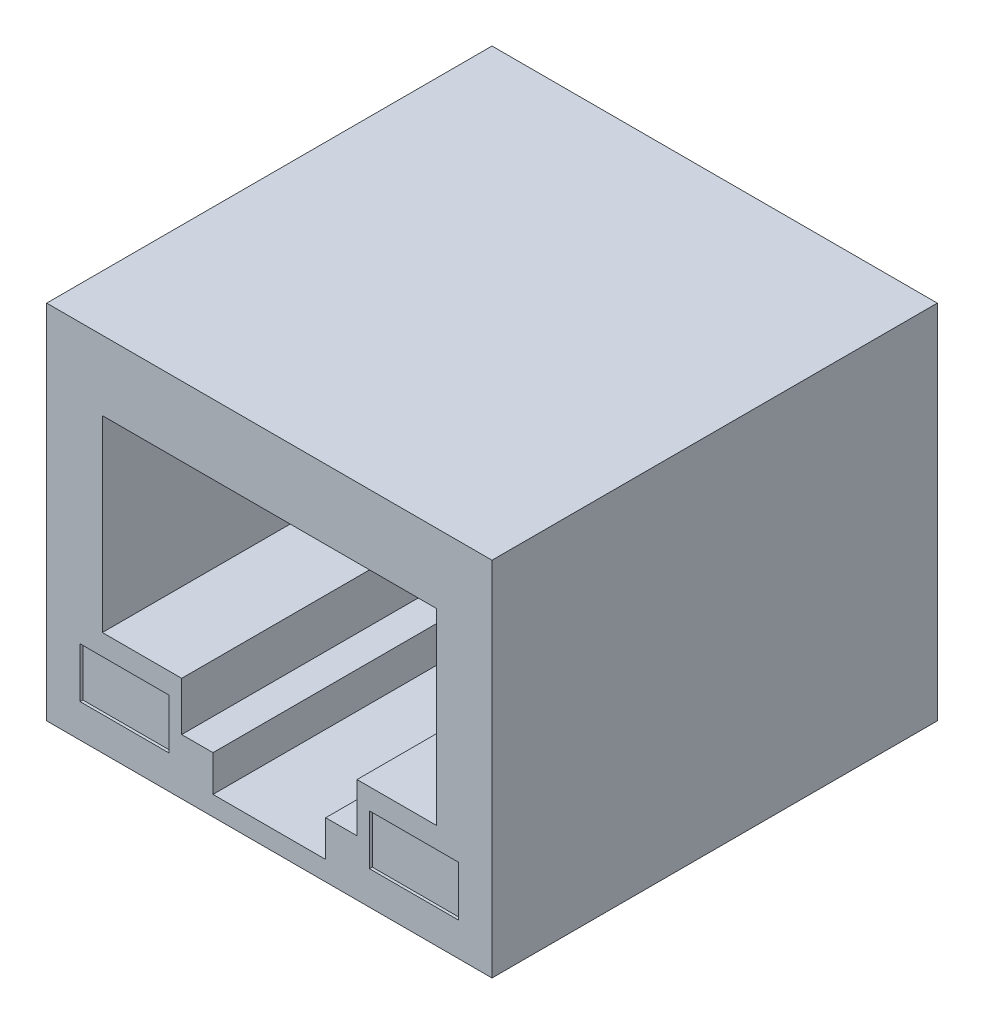
ISO-10303-21;
HEADER;
FILE_DESCRIPTION(('STEP AP214'),'2;1');
FILE_NAME('part.step','',(''),(''),'','','');
FILE_SCHEMA(('AUTOMOTIVE_DESIGN { 1 0 10303 214 1 1 1 1 }'));
ENDSEC;
DATA;
#1=APPLICATION_CONTEXT('core data for automotive mechanical design processes');
#2=APPLICATION_PROTOCOL_DEFINITION('international standard','automotive_design',2000,#1);
#3=PRODUCT_CONTEXT('',#1,'mechanical');
#4=PRODUCT('Part','Part','',(#3));
#5=PRODUCT_RELATED_PRODUCT_CATEGORY('part','',(#4));
#6=PRODUCT_DEFINITION_FORMATION('','',#4);
#7=PRODUCT_DEFINITION_CONTEXT('part definition',#1,'design');
#8=PRODUCT_DEFINITION('design','',#6,#7);
#9=PRODUCT_DEFINITION_SHAPE('','',#8);
#10=(LENGTH_UNIT() NAMED_UNIT(*) SI_UNIT(.MILLI.,.METRE.));
#11=(NAMED_UNIT(*) PLANE_ANGLE_UNIT() SI_UNIT($,.RADIAN.));
#12=(NAMED_UNIT(*) SI_UNIT($,.STERADIAN.) SOLID_ANGLE_UNIT());
#13=UNCERTAINTY_MEASURE_WITH_UNIT(LENGTH_MEASURE(1.E-05),#10,'distance_accuracy_value','');
#14=(GEOMETRIC_REPRESENTATION_CONTEXT(3) GLOBAL_UNCERTAINTY_ASSIGNED_CONTEXT((#13)) GLOBAL_UNIT_ASSIGNED_CONTEXT((#10,
#11,#12)) REPRESENTATION_CONTEXT('',''));
#15=CARTESIAN_POINT('',(0.,0.,0.));
#16=DIRECTION('',(0.,0.,1.));
#17=DIRECTION('',(1.,0.,0.));
#18=AXIS2_PLACEMENT_3D('',#15,#16,#17);
#19=CARTESIAN_POINT('',(-5.2,-8.4,-0.1));
#20=DIRECTION('',(0.,0.,1.));
#21=DIRECTION('',(1.,0.,0.));
#22=AXIS2_PLACEMENT_3D('',#19,#20,#21);
#23=PLANE('',#22);
#24=DIRECTION('',(0.,1.,0.));
#25=VECTOR('',#24,1.);
#26=CARTESIAN_POINT('',(-3.59999999999999,-9.3,-0.1));
#27=LINE('',#26,#25);
#28=CARTESIAN_POINT('',(-3.59999999999999,-9.3,-0.1));
#29=VERTEX_POINT('',#28);
#30=CARTESIAN_POINT('',(-3.59999999999999,-7.5,-0.1));
#31=VERTEX_POINT('',#30);
#32=EDGE_CURVE('E350',#29,#31,#27,.T.);
#33=ORIENTED_EDGE('',*,*,#32,.T.);
#34=DIRECTION('',(1.,0.,0.));
#35=VECTOR('',#34,1.);
#36=CARTESIAN_POINT('',(-3.59999999999999,-7.5,-0.1));
#37=LINE('',#36,#35);
#38=CARTESIAN_POINT('',(-6.8,-7.5,-0.1));
#39=VERTEX_POINT('',#38);
#40=EDGE_CURVE('E355',#31,#39,#37,.F.);
#41=ORIENTED_EDGE('',*,*,#40,.T.);
#42=DIRECTION('',(0.,1.,0.));
#43=VECTOR('',#42,1.);
#44=CARTESIAN_POINT('',(-6.8,-7.5,-0.1));
#45=LINE('',#44,#43);
#46=CARTESIAN_POINT('',(-6.8,-9.3,-0.1));
#47=VERTEX_POINT('',#46);
#48=EDGE_CURVE('E360',#39,#47,#45,.F.);
#49=ORIENTED_EDGE('',*,*,#48,.T.);
#50=DIRECTION('',(1.,0.,0.));
#51=VECTOR('',#50,1.);
#52=CARTESIAN_POINT('',(-6.8,-9.3,-0.1));
#53=LINE('',#52,#51);
#54=EDGE_CURVE('E342',#47,#29,#53,.T.);
#55=ORIENTED_EDGE('',*,*,#54,.T.);
#56=EDGE_LOOP('',(#33,#41,#49,#55));
#57=FACE_BOUND('',#56,.T.);
#58=ADVANCED_FACE('F36',(#57),#23,.T.);
#59=CARTESIAN_POINT('',(5.2,-8.4,-0.1));
#60=DIRECTION('',(0.,0.,1.));
#61=DIRECTION('',(1.,0.,0.));
#62=AXIS2_PLACEMENT_3D('',#59,#60,#61);
#63=PLANE('',#62);
#64=DIRECTION('',(0.,1.,0.));
#65=VECTOR('',#64,1.);
#66=CARTESIAN_POINT('',(6.8,-9.3,-0.1));
#67=LINE('',#66,#65);
#68=CARTESIAN_POINT('',(6.8,-9.3,-0.1));
#69=VERTEX_POINT('',#68);
#70=CARTESIAN_POINT('',(6.8,-7.5,-0.1));
#71=VERTEX_POINT('',#70);
#72=EDGE_CURVE('E330',#69,#71,#67,.T.);
#73=ORIENTED_EDGE('',*,*,#72,.T.);
#74=DIRECTION('',(1.,0.,0.));
#75=VECTOR('',#74,1.);
#76=CARTESIAN_POINT('',(6.8,-7.5,-0.1));
#77=LINE('',#76,#75);
#78=CARTESIAN_POINT('',(3.6,-7.5,-0.1));
#79=VERTEX_POINT('',#78);
#80=EDGE_CURVE('E335',#71,#79,#77,.F.);
#81=ORIENTED_EDGE('',*,*,#80,.T.);
#82=DIRECTION('',(0.,1.,0.));
#83=VECTOR('',#82,1.);
#84=CARTESIAN_POINT('',(3.6,-7.5,-0.1));
#85=LINE('',#84,#83);
#86=CARTESIAN_POINT('',(3.6,-9.3,-0.1));
#87=VERTEX_POINT('',#86);
#88=EDGE_CURVE('E340',#79,#87,#85,.F.);
#89=ORIENTED_EDGE('',*,*,#88,.T.);
#90=DIRECTION('',(1.,0.,0.));
#91=VECTOR('',#90,1.);
#92=CARTESIAN_POINT('',(3.6,-9.3,-0.1));
#93=LINE('',#92,#91);
#94=EDGE_CURVE('E322',#87,#69,#93,.T.);
#95=ORIENTED_EDGE('',*,*,#94,.T.);
#96=EDGE_LOOP('',(#73,#81,#89,#95));
#97=FACE_BOUND('',#96,.T.);
#98=ADVANCED_FACE('F512',(#97),#63,.T.);
#99=CARTESIAN_POINT('',(2.025,-8.5,0.));
#100=DIRECTION('',(0.,-1.,0.));
#101=DIRECTION('',(0.,0.,-1.));
#102=AXIS2_PLACEMENT_3D('',#99,#100,#101);
#103=PLANE('',#102);
#104=DIRECTION('',(0.,0.,-1.));
#105=VECTOR('',#104,1.);
#106=CARTESIAN_POINT('',(2.025,-8.5,0.));
#107=LINE('',#106,#105);
#108=CARTESIAN_POINT('',(2.025,-8.5,-10.7));
#109=VERTEX_POINT('',#108);
#110=CARTESIAN_POINT('',(2.025,-8.5,0.));
#111=VERTEX_POINT('',#110);
#112=EDGE_CURVE('E383',#109,#111,#107,.F.);
#113=ORIENTED_EDGE('',*,*,#112,.T.);
#114=DIRECTION('',(1.,0.,0.));
#115=VECTOR('',#114,1.);
#116=CARTESIAN_POINT('',(2.025,-8.5,0.));
#117=LINE('',#116,#115);
#118=CARTESIAN_POINT('',(3.15,-8.5,0.));
#119=VERTEX_POINT('',#118);
#120=EDGE_CURVE('E191',#119,#111,#117,.F.);
#121=ORIENTED_EDGE('',*,*,#120,.F.);
#122=DIRECTION('',(0.,0.,-1.));
#123=VECTOR('',#122,1.);
#124=CARTESIAN_POINT('',(3.15,-8.5,0.));
#125=LINE('',#124,#123);
#126=CARTESIAN_POINT('',(3.15,-8.5,-10.7));
#127=VERTEX_POINT('',#126);
#128=EDGE_CURVE('E301',#119,#127,#125,.T.);
#129=ORIENTED_EDGE('',*,*,#128,.T.);
#130=DIRECTION('',(1.,0.,0.));
#131=VECTOR('',#130,1.);
#132=CARTESIAN_POINT('',(0.,-8.5,-10.7));
#133=LINE('',#132,#131);
#134=EDGE_CURVE('E362',#109,#127,#133,.T.);
#135=ORIENTED_EDGE('',*,*,#134,.F.);
#136=EDGE_LOOP('',(#113,#121,#129,#135));
#137=FACE_BOUND('',#136,.T.);
#138=ADVANCED_FACE('F387',(#137),#103,.F.);
#139=CARTESIAN_POINT('',(2.025,-9.8,0.));
#140=DIRECTION('',(1.,0.,0.));
#141=DIRECTION('',(0.,0.,-1.));
#142=AXIS2_PLACEMENT_3D('',#139,#140,#141);
#143=PLANE('',#142);
#144=DIRECTION('',(0.,0.,-1.));
#145=VECTOR('',#144,1.);
#146=CARTESIAN_POINT('',(2.025,-9.8,0.));
#147=LINE('',#146,#145);
#148=CARTESIAN_POINT('',(2.025,-9.8,-10.7));
#149=VERTEX_POINT('',#148);
#150=CARTESIAN_POINT('',(2.025,-9.8,0.));
#151=VERTEX_POINT('',#150);
#152=EDGE_CURVE('E295',#149,#151,#147,.F.);
#153=ORIENTED_EDGE('',*,*,#152,.T.);
#154=DIRECTION('',(0.,1.,0.));
#155=VECTOR('',#154,1.);
#156=CARTESIAN_POINT('',(2.025,-9.8,0.));
#157=LINE('',#156,#155);
#158=EDGE_CURVE('E381',#111,#151,#157,.F.);
#159=ORIENTED_EDGE('',*,*,#158,.F.);
#160=ORIENTED_EDGE('',*,*,#112,.F.);
#161=DIRECTION('',(0.,1.,0.));
#162=VECTOR('',#161,1.);
#163=CARTESIAN_POINT('',(2.025,-4.4341743119266,-10.7));
#164=LINE('',#163,#162);
#165=EDGE_CURVE('E365',#149,#109,#164,.T.);
#166=ORIENTED_EDGE('',*,*,#165,.F.);
#167=EDGE_LOOP('',(#153,#159,#160,#166));
#168=FACE_BOUND('',#167,.T.);
#169=ADVANCED_FACE('F390',(#168),#143,.F.);
#170=CARTESIAN_POINT('',(-2.025,-8.5,0.));
#171=DIRECTION('',(-1.,0.,0.));
#172=DIRECTION('',(0.,0.,1.));
#173=AXIS2_PLACEMENT_3D('',#170,#171,#172);
#174=PLANE('',#173);
#175=DIRECTION('',(0.,0.,-1.));
#176=VECTOR('',#175,1.);
#177=CARTESIAN_POINT('',(-2.025,-8.5,0.));
#178=LINE('',#177,#176);
#179=CARTESIAN_POINT('',(-2.025,-8.5,-10.7));
#180=VERTEX_POINT('',#179);
#181=CARTESIAN_POINT('',(-2.025,-8.5,0.));
#182=VERTEX_POINT('',#181);
#183=EDGE_CURVE('E376',#180,#182,#178,.F.);
#184=ORIENTED_EDGE('',*,*,#183,.T.);
#185=DIRECTION('',(0.,1.,0.));
#186=VECTOR('',#185,1.);
#187=CARTESIAN_POINT('',(-2.025,-8.5,0.));
#188=LINE('',#187,#186);
#189=CARTESIAN_POINT('',(-2.025,-9.8,0.));
#190=VERTEX_POINT('',#189);
#191=EDGE_CURVE('E379',#190,#182,#188,.T.);
#192=ORIENTED_EDGE('',*,*,#191,.F.);
#193=DIRECTION('',(0.,0.,-1.));
#194=VECTOR('',#193,1.);
#195=CARTESIAN_POINT('',(-2.025,-9.8,0.));
#196=LINE('',#195,#194);
#197=CARTESIAN_POINT('',(-2.025,-9.8,-10.7));
#198=VERTEX_POINT('',#197);
#199=EDGE_CURVE('E293',#190,#198,#196,.T.);
#200=ORIENTED_EDGE('',*,*,#199,.T.);
#201=DIRECTION('',(0.,1.,0.));
#202=VECTOR('',#201,1.);
#203=CARTESIAN_POINT('',(-2.025,-4.4341743119266,-10.7));
#204=LINE('',#203,#202);
#205=EDGE_CURVE('E368',#180,#198,#204,.F.);
#206=ORIENTED_EDGE('',*,*,#205,.F.);
#207=EDGE_LOOP('',(#184,#192,#200,#206));
#208=FACE_BOUND('',#207,.T.);
#209=ADVANCED_FACE('F401',(#208),#174,.F.);
#210=CARTESIAN_POINT('',(-3.15,-8.5,0.));
#211=DIRECTION('',(0.,-1.,0.));
#212=DIRECTION('',(0.,0.,-1.));
#213=AXIS2_PLACEMENT_3D('',#210,#211,#212);
#214=PLANE('',#213);
#215=DIRECTION('',(0.,0.,1.));
#216=VECTOR('',#215,1.);
#217=CARTESIAN_POINT('',(-3.15,-8.5,0.));
#218=LINE('',#217,#216);
#219=CARTESIAN_POINT('',(-3.15,-8.5,-10.7));
#220=VERTEX_POINT('',#219);
#221=CARTESIAN_POINT('',(-3.15,-8.5,0.));
#222=VERTEX_POINT('',#221);
#223=EDGE_CURVE('E287',#220,#222,#218,.T.);
#224=ORIENTED_EDGE('',*,*,#223,.T.);
#225=DIRECTION('',(1.,0.,0.));
#226=VECTOR('',#225,1.);
#227=CARTESIAN_POINT('',(-3.15,-8.5,0.));
#228=LINE('',#227,#226);
#229=EDGE_CURVE('E374',#182,#222,#228,.F.);
#230=ORIENTED_EDGE('',*,*,#229,.F.);
#231=ORIENTED_EDGE('',*,*,#183,.F.);
#232=DIRECTION('',(1.,0.,0.));
#233=VECTOR('',#232,1.);
#234=CARTESIAN_POINT('',(0.,-8.5,-10.7));
#235=LINE('',#234,#233);
#236=EDGE_CURVE('E371',#220,#180,#235,.T.);
#237=ORIENTED_EDGE('',*,*,#236,.F.);
#238=EDGE_LOOP('',(#224,#230,#231,#237));
#239=FACE_BOUND('',#238,.T.);
#240=ADVANCED_FACE('F406',(#239),#214,.F.);
#241=CARTESIAN_POINT('',(0.,-4.4341743119266,-10.7));
#242=DIRECTION('',(0.,0.,1.));
#243=DIRECTION('',(1.,0.,0.));
#244=AXIS2_PLACEMENT_3D('',#241,#242,#243);
#245=PLANE('',#244);
#246=DIRECTION('',(0.,1.,0.));
#247=VECTOR('',#246,1.);
#248=CARTESIAN_POINT('',(6.,-6.75,-10.7));
#249=LINE('',#248,#247);
#250=CARTESIAN_POINT('',(6.,-6.75,-10.7));
#251=VERTEX_POINT('',#250);
#252=CARTESIAN_POINT('',(6.00000000000001,0.,-10.7));
#253=VERTEX_POINT('',#252);
#254=EDGE_CURVE('E310',#251,#253,#249,.T.);
#255=ORIENTED_EDGE('',*,*,#254,.T.);
#256=DIRECTION('',(1.,0.,0.));
#257=VECTOR('',#256,1.);
#258=CARTESIAN_POINT('',(0.,0.,-10.7));
#259=LINE('',#258,#257);
#260=CARTESIAN_POINT('',(-6.00000000000001,0.,-10.7));
#261=VERTEX_POINT('',#260);
#262=EDGE_CURVE('E315',#253,#261,#259,.F.);
#263=ORIENTED_EDGE('',*,*,#262,.T.);
#264=DIRECTION('',(0.,1.,0.));
#265=VECTOR('',#264,1.);
#266=CARTESIAN_POINT('',(-6.00000000000001,0.,-10.7));
#267=LINE('',#266,#265);
#268=CARTESIAN_POINT('',(-6.00000000000001,-6.75,-10.7));
#269=VERTEX_POINT('',#268);
#270=EDGE_CURVE('E320',#261,#269,#267,.F.);
#271=ORIENTED_EDGE('',*,*,#270,.T.);
#272=DIRECTION('',(1.,0.,0.));
#273=VECTOR('',#272,1.);
#274=CARTESIAN_POINT('',(-6.,-6.75,-10.7));
#275=LINE('',#274,#273);
#276=CARTESIAN_POINT('',(-3.15,-6.75,-10.7));
#277=VERTEX_POINT('',#276);
#278=EDGE_CURVE('E276',#269,#277,#275,.T.);
#279=ORIENTED_EDGE('',*,*,#278,.T.);
#280=DIRECTION('',(0.,1.,0.));
#281=VECTOR('',#280,1.);
#282=CARTESIAN_POINT('',(-3.15,-6.75,-10.7));
#283=LINE('',#282,#281);
#284=EDGE_CURVE('E284',#277,#220,#283,.F.);
#285=ORIENTED_EDGE('',*,*,#284,.T.);
#286=ORIENTED_EDGE('',*,*,#236,.T.);
#287=ORIENTED_EDGE('',*,*,#205,.T.);
#288=DIRECTION('',(1.,0.,0.));
#289=VECTOR('',#288,1.);
#290=CARTESIAN_POINT('',(-2.025,-9.8,-10.7));
#291=LINE('',#290,#289);
#292=EDGE_CURVE('E290',#198,#149,#291,.T.);
#293=ORIENTED_EDGE('',*,*,#292,.T.);
#294=ORIENTED_EDGE('',*,*,#165,.T.);
#295=ORIENTED_EDGE('',*,*,#134,.T.);
#296=DIRECTION('',(0.,1.,0.));
#297=VECTOR('',#296,1.);
#298=CARTESIAN_POINT('',(3.15,-8.5,-10.7));
#299=LINE('',#298,#297);
#300=CARTESIAN_POINT('',(3.15,-6.75,-10.7));
#301=VERTEX_POINT('',#300);
#302=EDGE_CURVE('E298',#127,#301,#299,.T.);
#303=ORIENTED_EDGE('',*,*,#302,.T.);
#304=DIRECTION('',(1.,0.,0.));
#305=VECTOR('',#304,1.);
#306=CARTESIAN_POINT('',(3.15,-6.75,-10.7));
#307=LINE('',#306,#305);
#308=EDGE_CURVE('E305',#301,#251,#307,.T.);
#309=ORIENTED_EDGE('',*,*,#308,.T.);
#310=EDGE_LOOP('',(#255,#263,#271,#279,#285,#286,#287,#293,#294,#295,#303,#309));
#311=FACE_BOUND('',#310,.T.);
#312=ADVANCED_FACE('F403',(#311),#245,.T.);
#313=CARTESIAN_POINT('',(-6.8,-7.5,0.));
#314=DIRECTION('',(-1.,0.,0.));
#315=DIRECTION('',(0.,0.,1.));
#316=AXIS2_PLACEMENT_3D('',#313,#314,#315);
#317=PLANE('',#316);
#318=DIRECTION('',(0.,0.,1.));
#319=VECTOR('',#318,1.);
#320=CARTESIAN_POINT('',(-6.8,-7.5,0.));
#321=LINE('',#320,#319);
#322=CARTESIAN_POINT('',(-6.8,-7.5,0.));
#323=VERTEX_POINT('',#322);
#324=EDGE_CURVE('E358',#39,#323,#321,.T.);
#325=ORIENTED_EDGE('',*,*,#324,.T.);
#326=DIRECTION('',(0.,1.,0.));
#327=VECTOR('',#326,1.);
#328=CARTESIAN_POINT('',(-6.8,-4.,0.));
#329=LINE('',#328,#327);
#330=CARTESIAN_POINT('',(-6.8,-9.3,0.));
#331=VERTEX_POINT('',#330);
#332=EDGE_CURVE('E266',#331,#323,#329,.T.);
#333=ORIENTED_EDGE('',*,*,#332,.F.);
#334=DIRECTION('',(0.,0.,-1.));
#335=VECTOR('',#334,1.);
#336=CARTESIAN_POINT('',(-6.8,-9.3,0.));
#337=LINE('',#336,#335);
#338=EDGE_CURVE('E345',#331,#47,#337,.T.);
#339=ORIENTED_EDGE('',*,*,#338,.T.);
#340=ORIENTED_EDGE('',*,*,#48,.F.);
#341=EDGE_LOOP('',(#325,#333,#339,#340));
#342=FACE_BOUND('',#341,.T.);
#343=ADVANCED_FACE('F567',(#342),#317,.F.);
#344=CARTESIAN_POINT('',(-3.59999999999999,-7.5,0.));
#345=DIRECTION('',(0.,1.,0.));
#346=DIRECTION('',(0.,0.,1.));
#347=AXIS2_PLACEMENT_3D('',#344,#345,#346);
#348=PLANE('',#347);
#349=DIRECTION('',(0.,0.,-1.));
#350=VECTOR('',#349,1.);
#351=CARTESIAN_POINT('',(-3.59999999999999,-7.5,0.));
#352=LINE('',#351,#350);
#353=CARTESIAN_POINT('',(-3.59999999999999,-7.5,0.));
#354=VERTEX_POINT('',#353);
#355=EDGE_CURVE('E353',#31,#354,#352,.F.);
#356=ORIENTED_EDGE('',*,*,#355,.T.);
#357=DIRECTION('',(1.,0.,0.));
#358=VECTOR('',#357,1.);
#359=CARTESIAN_POINT('',(0.,-7.5,0.));
#360=LINE('',#359,#358);
#361=EDGE_CURVE('E263',#323,#354,#360,.T.);
#362=ORIENTED_EDGE('',*,*,#361,.F.);
#363=ORIENTED_EDGE('',*,*,#324,.F.);
#364=ORIENTED_EDGE('',*,*,#40,.F.);
#365=EDGE_LOOP('',(#356,#362,#363,#364));
#366=FACE_BOUND('',#365,.T.);
#367=ADVANCED_FACE('F577',(#366),#348,.F.);
#368=CARTESIAN_POINT('',(-3.59999999999999,-9.3,0.));
#369=DIRECTION('',(1.,0.,0.));
#370=DIRECTION('',(0.,0.,-1.));
#371=AXIS2_PLACEMENT_3D('',#368,#369,#370);
#372=PLANE('',#371);
#373=DIRECTION('',(0.,0.,-1.));
#374=VECTOR('',#373,1.);
#375=CARTESIAN_POINT('',(-3.59999999999999,-9.3,0.));
#376=LINE('',#375,#374);
#377=CARTESIAN_POINT('',(-3.59999999999999,-9.3,0.));
#378=VERTEX_POINT('',#377);
#379=EDGE_CURVE('E348',#29,#378,#376,.F.);
#380=ORIENTED_EDGE('',*,*,#379,.T.);
#381=DIRECTION('',(0.,1.,0.));
#382=VECTOR('',#381,1.);
#383=CARTESIAN_POINT('',(-3.59999999999999,-4.,0.));
#384=LINE('',#383,#382);
#385=EDGE_CURVE('E260',#354,#378,#384,.F.);
#386=ORIENTED_EDGE('',*,*,#385,.F.);
#387=ORIENTED_EDGE('',*,*,#355,.F.);
#388=ORIENTED_EDGE('',*,*,#32,.F.);
#389=EDGE_LOOP('',(#380,#386,#387,#388));
#390=FACE_BOUND('',#389,.T.);
#391=ADVANCED_FACE('F588',(#390),#372,.F.);
#392=CARTESIAN_POINT('',(-6.8,-9.3,0.));
#393=DIRECTION('',(0.,-1.,0.));
#394=DIRECTION('',(0.,0.,-1.));
#395=AXIS2_PLACEMENT_3D('',#392,#393,#394);
#396=PLANE('',#395);
#397=ORIENTED_EDGE('',*,*,#338,.F.);
#398=DIRECTION('',(1.,0.,0.));
#399=VECTOR('',#398,1.);
#400=CARTESIAN_POINT('',(0.,-9.3,0.));
#401=LINE('',#400,#399);
#402=EDGE_CURVE('E257',#378,#331,#401,.F.);
#403=ORIENTED_EDGE('',*,*,#402,.F.);
#404=ORIENTED_EDGE('',*,*,#379,.F.);
#405=ORIENTED_EDGE('',*,*,#54,.F.);
#406=EDGE_LOOP('',(#397,#403,#404,#405));
#407=FACE_BOUND('',#406,.T.);
#408=ADVANCED_FACE('F599',(#407),#396,.F.);
#409=CARTESIAN_POINT('',(3.6,-7.5,0.));
#410=DIRECTION('',(-1.,0.,0.));
#411=DIRECTION('',(0.,0.,1.));
#412=AXIS2_PLACEMENT_3D('',#409,#410,#411);
#413=PLANE('',#412);
#414=DIRECTION('',(0.,0.,1.));
#415=VECTOR('',#414,1.);
#416=CARTESIAN_POINT('',(3.6,-7.5,0.));
#417=LINE('',#416,#415);
#418=CARTESIAN_POINT('',(3.6,-7.5,0.));
#419=VERTEX_POINT('',#418);
#420=EDGE_CURVE('E338',#79,#419,#417,.T.);
#421=ORIENTED_EDGE('',*,*,#420,.T.);
#422=DIRECTION('',(0.,1.,0.));
#423=VECTOR('',#422,1.);
#424=CARTESIAN_POINT('',(3.6,-4.,0.));
#425=LINE('',#424,#423);
#426=CARTESIAN_POINT('',(3.6,-9.3,0.));
#427=VERTEX_POINT('',#426);
#428=EDGE_CURVE('E254',#427,#419,#425,.T.);
#429=ORIENTED_EDGE('',*,*,#428,.F.);
#430=DIRECTION('',(0.,0.,-1.));
#431=VECTOR('',#430,1.);
#432=CARTESIAN_POINT('',(3.6,-9.3,0.));
#433=LINE('',#432,#431);
#434=EDGE_CURVE('E325',#427,#87,#433,.T.);
#435=ORIENTED_EDGE('',*,*,#434,.T.);
#436=ORIENTED_EDGE('',*,*,#88,.F.);
#437=EDGE_LOOP('',(#421,#429,#435,#436));
#438=FACE_BOUND('',#437,.T.);
#439=ADVANCED_FACE('F610',(#438),#413,.F.);
#440=CARTESIAN_POINT('',(6.8,-7.5,0.));
#441=DIRECTION('',(0.,1.,0.));
#442=DIRECTION('',(0.,0.,1.));
#443=AXIS2_PLACEMENT_3D('',#440,#441,#442);
#444=PLANE('',#443);
#445=DIRECTION('',(0.,0.,-1.));
#446=VECTOR('',#445,1.);
#447=CARTESIAN_POINT('',(6.8,-7.5,0.));
#448=LINE('',#447,#446);
#449=CARTESIAN_POINT('',(6.8,-7.5,0.));
#450=VERTEX_POINT('',#449);
#451=EDGE_CURVE('E333',#71,#450,#448,.F.);
#452=ORIENTED_EDGE('',*,*,#451,.T.);
#453=DIRECTION('',(1.,0.,0.));
#454=VECTOR('',#453,1.);
#455=CARTESIAN_POINT('',(0.,-7.5,0.));
#456=LINE('',#455,#454);
#457=EDGE_CURVE('E251',#419,#450,#456,.T.);
#458=ORIENTED_EDGE('',*,*,#457,.F.);
#459=ORIENTED_EDGE('',*,*,#420,.F.);
#460=ORIENTED_EDGE('',*,*,#80,.F.);
#461=EDGE_LOOP('',(#452,#458,#459,#460));
#462=FACE_BOUND('',#461,.T.);
#463=ADVANCED_FACE('F621',(#462),#444,.F.);
#464=CARTESIAN_POINT('',(6.8,-9.3,0.));
#465=DIRECTION('',(1.,0.,0.));
#466=DIRECTION('',(0.,0.,-1.));
#467=AXIS2_PLACEMENT_3D('',#464,#465,#466);
#468=PLANE('',#467);
#469=DIRECTION('',(0.,0.,-1.));
#470=VECTOR('',#469,1.);
#471=CARTESIAN_POINT('',(6.8,-9.3,0.));
#472=LINE('',#471,#470);
#473=CARTESIAN_POINT('',(6.8,-9.3,0.));
#474=VERTEX_POINT('',#473);
#475=EDGE_CURVE('E328',#69,#474,#472,.F.);
#476=ORIENTED_EDGE('',*,*,#475,.T.);
#477=DIRECTION('',(0.,1.,0.));
#478=VECTOR('',#477,1.);
#479=CARTESIAN_POINT('',(6.8,-4.,0.));
#480=LINE('',#479,#478);
#481=EDGE_CURVE('E248',#450,#474,#480,.F.);
#482=ORIENTED_EDGE('',*,*,#481,.F.);
#483=ORIENTED_EDGE('',*,*,#451,.F.);
#484=ORIENTED_EDGE('',*,*,#72,.F.);
#485=EDGE_LOOP('',(#476,#482,#483,#484));
#486=FACE_BOUND('',#485,.T.);
#487=ADVANCED_FACE('F632',(#486),#468,.F.);
#488=CARTESIAN_POINT('',(3.6,-9.3,0.));
#489=DIRECTION('',(0.,-1.,0.));
#490=DIRECTION('',(0.,0.,-1.));
#491=AXIS2_PLACEMENT_3D('',#488,#489,#490);
#492=PLANE('',#491);
#493=ORIENTED_EDGE('',*,*,#434,.F.);
#494=DIRECTION('',(1.,0.,0.));
#495=VECTOR('',#494,1.);
#496=CARTESIAN_POINT('',(0.,-9.3,0.));
#497=LINE('',#496,#495);
#498=EDGE_CURVE('E245',#474,#427,#497,.F.);
#499=ORIENTED_EDGE('',*,*,#498,.F.);
#500=ORIENTED_EDGE('',*,*,#475,.F.);
#501=ORIENTED_EDGE('',*,*,#94,.F.);
#502=EDGE_LOOP('',(#493,#499,#500,#501));
#503=FACE_BOUND('',#502,.T.);
#504=ADVANCED_FACE('F643',(#503),#492,.F.);
#505=CARTESIAN_POINT('',(-6.00000000000001,0.,0.));
#506=DIRECTION('',(-1.,0.,0.));
#507=DIRECTION('',(0.,0.,1.));
#508=AXIS2_PLACEMENT_3D('',#505,#506,#507);
#509=PLANE('',#508);
#510=DIRECTION('',(0.,0.,1.));
#511=VECTOR('',#510,1.);
#512=CARTESIAN_POINT('',(-6.00000000000001,0.,0.));
#513=LINE('',#512,#511);
#514=CARTESIAN_POINT('',(-6.00000000000001,0.,0.));
#515=VERTEX_POINT('',#514);
#516=EDGE_CURVE('E318',#261,#515,#513,.T.);
#517=ORIENTED_EDGE('',*,*,#516,.T.);
#518=DIRECTION('',(0.,1.,0.));
#519=VECTOR('',#518,1.);
#520=CARTESIAN_POINT('',(-6.,-4.,0.));
#521=LINE('',#520,#519);
#522=CARTESIAN_POINT('',(-6.00000000000001,-6.75,0.));
#523=VERTEX_POINT('',#522);
#524=EDGE_CURVE('E242',#523,#515,#521,.T.);
#525=ORIENTED_EDGE('',*,*,#524,.F.);
#526=DIRECTION('',(0.,0.,-1.));
#527=VECTOR('',#526,1.);
#528=CARTESIAN_POINT('',(-6.,-6.75,0.));
#529=LINE('',#528,#527);
#530=EDGE_CURVE('E279',#523,#269,#529,.T.);
#531=ORIENTED_EDGE('',*,*,#530,.T.);
#532=ORIENTED_EDGE('',*,*,#270,.F.);
#533=EDGE_LOOP('',(#517,#525,#531,#532));
#534=FACE_BOUND('',#533,.T.);
#535=ADVANCED_FACE('F418',(#534),#509,.F.);
#536=CARTESIAN_POINT('',(0.,0.,0.));
#537=DIRECTION('',(0.,1.,0.));
#538=DIRECTION('',(0.,0.,1.));
#539=AXIS2_PLACEMENT_3D('',#536,#537,#538);
#540=PLANE('',#539);
#541=DIRECTION('',(0.,0.,-1.));
#542=VECTOR('',#541,1.);
#543=CARTESIAN_POINT('',(6.,0.,0.));
#544=LINE('',#543,#542);
#545=CARTESIAN_POINT('',(6.00000000000001,0.,0.));
#546=VERTEX_POINT('',#545);
#547=EDGE_CURVE('E313',#253,#546,#544,.F.);
#548=ORIENTED_EDGE('',*,*,#547,.T.);
#549=DIRECTION('',(1.,0.,0.));
#550=VECTOR('',#549,1.);
#551=CARTESIAN_POINT('',(0.,0.,0.));
#552=LINE('',#551,#550);
#553=EDGE_CURVE('E239',#515,#546,#552,.T.);
#554=ORIENTED_EDGE('',*,*,#553,.F.);
#555=ORIENTED_EDGE('',*,*,#516,.F.);
#556=ORIENTED_EDGE('',*,*,#262,.F.);
#557=EDGE_LOOP('',(#548,#554,#555,#556));
#558=FACE_BOUND('',#557,.T.);
#559=ADVANCED_FACE('F423',(#558),#540,.F.);
#560=CARTESIAN_POINT('',(6.,-6.75,0.));
#561=DIRECTION('',(1.,0.,0.));
#562=DIRECTION('',(0.,0.,-1.));
#563=AXIS2_PLACEMENT_3D('',#560,#561,#562);
#564=PLANE('',#563);
#565=DIRECTION('',(0.,0.,-1.));
#566=VECTOR('',#565,1.);
#567=CARTESIAN_POINT('',(6.,-6.75,0.));
#568=LINE('',#567,#566);
#569=CARTESIAN_POINT('',(6.,-6.75,0.));
#570=VERTEX_POINT('',#569);
#571=EDGE_CURVE('E308',#251,#570,#568,.F.);
#572=ORIENTED_EDGE('',*,*,#571,.T.);
#573=DIRECTION('',(0.,1.,0.));
#574=VECTOR('',#573,1.);
#575=CARTESIAN_POINT('',(6.00000000000001,-4.,0.));
#576=LINE('',#575,#574);
#577=EDGE_CURVE('E236',#546,#570,#576,.F.);
#578=ORIENTED_EDGE('',*,*,#577,.F.);
#579=ORIENTED_EDGE('',*,*,#547,.F.);
#580=ORIENTED_EDGE('',*,*,#254,.F.);
#581=EDGE_LOOP('',(#572,#578,#579,#580));
#582=FACE_BOUND('',#581,.T.);
#583=ADVANCED_FACE('F426',(#582),#564,.F.);
#584=CARTESIAN_POINT('',(3.15,-6.75,0.));
#585=DIRECTION('',(0.,-1.,0.));
#586=DIRECTION('',(0.,0.,-1.));
#587=AXIS2_PLACEMENT_3D('',#584,#585,#586);
#588=PLANE('',#587);
#589=DIRECTION('',(0.,0.,-1.));
#590=VECTOR('',#589,1.);
#591=CARTESIAN_POINT('',(3.15,-6.75,0.));
#592=LINE('',#591,#590);
#593=CARTESIAN_POINT('',(3.15,-6.75,0.));
#594=VERTEX_POINT('',#593);
#595=EDGE_CURVE('E303',#301,#594,#592,.F.);
#596=ORIENTED_EDGE('',*,*,#595,.T.);
#597=DIRECTION('',(1.,0.,0.));
#598=VECTOR('',#597,1.);
#599=CARTESIAN_POINT('',(0.,-6.75,0.));
#600=LINE('',#599,#598);
#601=EDGE_CURVE('E233',#570,#594,#600,.F.);
#602=ORIENTED_EDGE('',*,*,#601,.F.);
#603=ORIENTED_EDGE('',*,*,#571,.F.);
#604=ORIENTED_EDGE('',*,*,#308,.F.);
#605=EDGE_LOOP('',(#596,#602,#603,#604));
#606=FACE_BOUND('',#605,.T.);
#607=ADVANCED_FACE('F430',(#606),#588,.F.);
#608=CARTESIAN_POINT('',(3.15,-8.5,0.));
#609=DIRECTION('',(1.,0.,0.));
#610=DIRECTION('',(0.,0.,-1.));
#611=AXIS2_PLACEMENT_3D('',#608,#609,#610);
#612=PLANE('',#611);
#613=ORIENTED_EDGE('',*,*,#128,.F.);
#614=DIRECTION('',(0.,1.,0.));
#615=VECTOR('',#614,1.);
#616=CARTESIAN_POINT('',(3.15,-4.,0.));
#617=LINE('',#616,#615);
#618=EDGE_CURVE('E231',#594,#119,#617,.F.);
#619=ORIENTED_EDGE('',*,*,#618,.F.);
#620=ORIENTED_EDGE('',*,*,#595,.F.);
#621=ORIENTED_EDGE('',*,*,#302,.F.);
#622=EDGE_LOOP('',(#613,#619,#620,#621));
#623=FACE_BOUND('',#622,.T.);
#624=ADVANCED_FACE('F434',(#623),#612,.F.);
#625=CARTESIAN_POINT('',(-2.025,-9.8,0.));
#626=DIRECTION('',(0.,-1.,0.));
#627=DIRECTION('',(0.,0.,-1.));
#628=AXIS2_PLACEMENT_3D('',#625,#626,#627);
#629=PLANE('',#628);
#630=ORIENTED_EDGE('',*,*,#199,.F.);
#631=DIRECTION('',(1.,0.,0.));
#632=VECTOR('',#631,1.);
#633=CARTESIAN_POINT('',(0.,-9.8,0.));
#634=LINE('',#633,#632);
#635=EDGE_CURVE('E228',#151,#190,#634,.F.);
#636=ORIENTED_EDGE('',*,*,#635,.F.);
#637=ORIENTED_EDGE('',*,*,#152,.F.);
#638=ORIENTED_EDGE('',*,*,#292,.F.);
#639=EDGE_LOOP('',(#630,#636,#637,#638));
#640=FACE_BOUND('',#639,.T.);
#641=ADVANCED_FACE('F397',(#640),#629,.F.);
#642=CARTESIAN_POINT('',(-3.15,-6.75,0.));
#643=DIRECTION('',(-1.,0.,0.));
#644=DIRECTION('',(0.,0.,1.));
#645=AXIS2_PLACEMENT_3D('',#642,#643,#644);
#646=PLANE('',#645);
#647=DIRECTION('',(0.,0.,-1.));
#648=VECTOR('',#647,1.);
#649=CARTESIAN_POINT('',(-3.15,-6.75,0.));
#650=LINE('',#649,#648);
#651=CARTESIAN_POINT('',(-3.15,-6.75,0.));
#652=VERTEX_POINT('',#651);
#653=EDGE_CURVE('E282',#277,#652,#650,.F.);
#654=ORIENTED_EDGE('',*,*,#653,.T.);
#655=DIRECTION('',(0.,1.,0.));
#656=VECTOR('',#655,1.);
#657=CARTESIAN_POINT('',(-3.15,-4.,0.));
#658=LINE('',#657,#656);
#659=EDGE_CURVE('E225',#222,#652,#658,.T.);
#660=ORIENTED_EDGE('',*,*,#659,.F.);
#661=ORIENTED_EDGE('',*,*,#223,.F.);
#662=ORIENTED_EDGE('',*,*,#284,.F.);
#663=EDGE_LOOP('',(#654,#660,#661,#662));
#664=FACE_BOUND('',#663,.T.);
#665=ADVANCED_FACE('F411',(#664),#646,.F.);
#666=CARTESIAN_POINT('',(-6.,-6.75,0.));
#667=DIRECTION('',(0.,-1.,0.));
#668=DIRECTION('',(0.,0.,-1.));
#669=AXIS2_PLACEMENT_3D('',#666,#667,#668);
#670=PLANE('',#669);
#671=ORIENTED_EDGE('',*,*,#530,.F.);
#672=DIRECTION('',(1.,0.,0.));
#673=VECTOR('',#672,1.);
#674=CARTESIAN_POINT('',(0.,-6.75,0.));
#675=LINE('',#674,#673);
#676=EDGE_CURVE('E222',#652,#523,#675,.F.);
#677=ORIENTED_EDGE('',*,*,#676,.F.);
#678=ORIENTED_EDGE('',*,*,#653,.F.);
#679=ORIENTED_EDGE('',*,*,#278,.F.);
#680=EDGE_LOOP('',(#671,#677,#678,#679));
#681=FACE_BOUND('',#680,.T.);
#682=ADVANCED_FACE('F416',(#681),#670,.F.);
#683=CARTESIAN_POINT('',(-7.99999999999999,-10.5,0.));
#684=DIRECTION('',(0.,-1.,0.));
#685=DIRECTION('',(0.,0.,-1.));
#686=AXIS2_PLACEMENT_3D('',#683,#684,#685);
#687=PLANE('',#686);
#688=DIRECTION('',(1.,0.,0.));
#689=VECTOR('',#688,1.);
#690=CARTESIAN_POINT('',(8.85489735414398,-10.5,-16.));
#691=LINE('',#690,#689);
#692=CARTESIAN_POINT('',(-8.,-10.5,-16.));
#693=VERTEX_POINT('',#692);
#694=CARTESIAN_POINT('',(8.,-10.5,-16.));
#695=VERTEX_POINT('',#694);
#696=EDGE_CURVE('E199',#693,#695,#691,.T.);
#697=ORIENTED_EDGE('',*,*,#696,.T.);
#698=DIRECTION('',(0.,0.,-1.));
#699=VECTOR('',#698,1.);
#700=CARTESIAN_POINT('',(8.,-10.5,0.));
#701=LINE('',#700,#699);
#702=CARTESIAN_POINT('',(8.,-10.5,0.));
#703=VERTEX_POINT('',#702);
#704=EDGE_CURVE('E210',#703,#695,#701,.T.);
#705=ORIENTED_EDGE('',*,*,#704,.F.);
#706=DIRECTION('',(1.,0.,0.));
#707=VECTOR('',#706,1.);
#708=CARTESIAN_POINT('',(0.,-10.5,0.));
#709=LINE('',#708,#707);
#710=CARTESIAN_POINT('',(-8.,-10.5,0.));
#711=VERTEX_POINT('',#710);
#712=EDGE_CURVE('E269',#711,#703,#709,.T.);
#713=ORIENTED_EDGE('',*,*,#712,.F.);
#714=DIRECTION('',(0.,0.,1.));
#715=VECTOR('',#714,1.);
#716=CARTESIAN_POINT('',(-8.,-10.5,0.));
#717=LINE('',#716,#715);
#718=EDGE_CURVE('E274',#693,#711,#717,.T.);
#719=ORIENTED_EDGE('',*,*,#718,.F.);
#720=EDGE_LOOP('',(#697,#705,#713,#719));
#721=FACE_BOUND('',#720,.T.);
#722=ADVANCED_FACE('F458',(#721),#687,.T.);
#723=CARTESIAN_POINT('',(-8.,2.5,0.));
#724=DIRECTION('',(-1.,0.,0.));
#725=DIRECTION('',(0.,0.,1.));
#726=AXIS2_PLACEMENT_3D('',#723,#724,#725);
#727=PLANE('',#726);
#728=DIRECTION('',(0.,1.,0.));
#729=VECTOR('',#728,1.);
#730=CARTESIAN_POINT('',(-8.,2.5,-16.));
#731=LINE('',#730,#729);
#732=CARTESIAN_POINT('',(-8.,2.5,-16.));
#733=VERTEX_POINT('',#732);
#734=EDGE_CURVE('E49',#693,#733,#731,.T.);
#735=ORIENTED_EDGE('',*,*,#734,.F.);
#736=ORIENTED_EDGE('',*,*,#718,.T.);
#737=DIRECTION('',(0.,1.,0.));
#738=VECTOR('',#737,1.);
#739=CARTESIAN_POINT('',(-8.,-4.,0.));
#740=LINE('',#739,#738);
#741=CARTESIAN_POINT('',(-8.,2.5,0.));
#742=VERTEX_POINT('',#741);
#743=EDGE_CURVE('E271',#742,#711,#740,.F.);
#744=ORIENTED_EDGE('',*,*,#743,.F.);
#745=DIRECTION('',(0.,0.,1.));
#746=VECTOR('',#745,1.);
#747=CARTESIAN_POINT('',(-8.,2.5,0.));
#748=LINE('',#747,#746);
#749=EDGE_CURVE('E215',#733,#742,#748,.T.);
#750=ORIENTED_EDGE('',*,*,#749,.F.);
#751=EDGE_LOOP('',(#735,#736,#744,#750));
#752=FACE_BOUND('',#751,.T.);
#753=ADVANCED_FACE('F455',(#752),#727,.T.);
#754=CARTESIAN_POINT('',(0.,-4.,0.));
#755=DIRECTION('',(0.,0.,1.));
#756=DIRECTION('',(1.,0.,0.));
#757=AXIS2_PLACEMENT_3D('',#754,#755,#756);
#758=PLANE('',#757);
#759=ORIENTED_EDGE('',*,*,#659,.T.);
#760=ORIENTED_EDGE('',*,*,#676,.T.);
#761=ORIENTED_EDGE('',*,*,#524,.T.);
#762=ORIENTED_EDGE('',*,*,#553,.T.);
#763=ORIENTED_EDGE('',*,*,#577,.T.);
#764=ORIENTED_EDGE('',*,*,#601,.T.);
#765=ORIENTED_EDGE('',*,*,#618,.T.);
#766=ORIENTED_EDGE('',*,*,#120,.T.);
#767=ORIENTED_EDGE('',*,*,#158,.T.);
#768=ORIENTED_EDGE('',*,*,#635,.T.);
#769=ORIENTED_EDGE('',*,*,#191,.T.);
#770=ORIENTED_EDGE('',*,*,#229,.T.);
#771=EDGE_LOOP('',(#759,#760,#761,#762,#763,#764,#765,#766,#767,#768,#769,#770));
#772=FACE_BOUND('',#771,.T.);
#773=ORIENTED_EDGE('',*,*,#481,.T.);
#774=ORIENTED_EDGE('',*,*,#498,.T.);
#775=ORIENTED_EDGE('',*,*,#428,.T.);
#776=ORIENTED_EDGE('',*,*,#457,.T.);
#777=EDGE_LOOP('',(#773,#774,#775,#776));
#778=FACE_BOUND('',#777,.T.);
#779=ORIENTED_EDGE('',*,*,#385,.T.);
#780=ORIENTED_EDGE('',*,*,#402,.T.);
#781=ORIENTED_EDGE('',*,*,#332,.T.);
#782=ORIENTED_EDGE('',*,*,#361,.T.);
#783=EDGE_LOOP('',(#779,#780,#781,#782));
#784=FACE_BOUND('',#783,.T.);
#785=ORIENTED_EDGE('',*,*,#712,.T.);
#786=DIRECTION('',(0.,1.,0.));
#787=VECTOR('',#786,1.);
#788=CARTESIAN_POINT('',(8.,-10.5,0.));
#789=LINE('',#788,#787);
#790=CARTESIAN_POINT('',(8.,2.5,0.));
#791=VERTEX_POINT('',#790);
#792=EDGE_CURVE('E58',#791,#703,#789,.F.);
#793=ORIENTED_EDGE('',*,*,#792,.F.);
#794=DIRECTION('',(1.,0.,0.));
#795=VECTOR('',#794,1.);
#796=CARTESIAN_POINT('',(0.,2.5,0.));
#797=LINE('',#796,#795);
#798=EDGE_CURVE('E213',#742,#791,#797,.T.);
#799=ORIENTED_EDGE('',*,*,#798,.F.);
#800=ORIENTED_EDGE('',*,*,#743,.T.);
#801=EDGE_LOOP('',(#785,#793,#799,#800));
#802=FACE_BOUND('',#801,.T.);
#803=ADVANCED_FACE('F393',(#772,#778,#784,#802),#758,.T.);
#804=CARTESIAN_POINT('',(8.,-10.5,0.));
#805=DIRECTION('',(1.,0.,0.));
#806=DIRECTION('',(0.,0.,-1.));
#807=AXIS2_PLACEMENT_3D('',#804,#805,#806);
#808=PLANE('',#807);
#809=DIRECTION('',(0.,-1.,0.));
#810=VECTOR('',#809,1.);
#811=CARTESIAN_POINT('',(8.,-10.5,-16.));
#812=LINE('',#811,#810);
#813=CARTESIAN_POINT('',(8.,2.5,-16.));
#814=VERTEX_POINT('',#813);
#815=EDGE_CURVE('E196',#814,#695,#812,.T.);
#816=ORIENTED_EDGE('',*,*,#815,.F.);
#817=DIRECTION('',(0.,0.,1.));
#818=VECTOR('',#817,1.);
#819=CARTESIAN_POINT('',(8.,2.5,0.));
#820=LINE('',#819,#818);
#821=EDGE_CURVE('E43',#791,#814,#820,.F.);
#822=ORIENTED_EDGE('',*,*,#821,.F.);
#823=ORIENTED_EDGE('',*,*,#792,.T.);
#824=ORIENTED_EDGE('',*,*,#704,.T.);
#825=EDGE_LOOP('',(#816,#822,#823,#824));
#826=FACE_BOUND('',#825,.T.);
#827=ADVANCED_FACE('F207',(#826),#808,.T.);
#828=CARTESIAN_POINT('',(0.,2.5,0.));
#829=DIRECTION('',(0.,1.,0.));
#830=DIRECTION('',(0.,0.,1.));
#831=AXIS2_PLACEMENT_3D('',#828,#829,#830);
#832=PLANE('',#831);
#833=DIRECTION('',(1.,0.,0.));
#834=VECTOR('',#833,1.);
#835=CARTESIAN_POINT('',(0.,2.5,-16.));
#836=LINE('',#835,#834);
#837=EDGE_CURVE('E11',#733,#814,#836,.T.);
#838=ORIENTED_EDGE('',*,*,#837,.F.);
#839=ORIENTED_EDGE('',*,*,#749,.T.);
#840=ORIENTED_EDGE('',*,*,#798,.T.);
#841=ORIENTED_EDGE('',*,*,#821,.T.);
#842=EDGE_LOOP('',(#838,#839,#840,#841));
#843=FACE_BOUND('',#842,.T.);
#844=ADVANCED_FACE('F212',(#843),#832,.T.);
#845=CARTESIAN_POINT('',(8.85489735414398,-10.5,-16.));
#846=DIRECTION('',(0.,0.,1.));
#847=DIRECTION('',(1.,0.,0.));
#848=AXIS2_PLACEMENT_3D('',#845,#846,#847);
#849=PLANE('',#848);
#850=ORIENTED_EDGE('',*,*,#734,.T.);
#851=ORIENTED_EDGE('',*,*,#837,.T.);
#852=ORIENTED_EDGE('',*,*,#815,.T.);
#853=ORIENTED_EDGE('',*,*,#696,.F.);
#854=EDGE_LOOP('',(#850,#851,#852,#853));
#855=FACE_BOUND('',#854,.T.);
#856=ADVANCED_FACE('F201',(#855),#849,.F.);
#857=CLOSED_SHELL('',(#58,#98,#138,#169,#209,#240,#312,#343,#367,#391,#408,#439,#463,#487,#504,
#535,#559,#583,#607,#624,#641,#665,#682,#722,#753,#803,#827,#844,#856));
#858=MANIFOLD_SOLID_BREP('B2',#857);
#859=ADVANCED_BREP_SHAPE_REPRESENTATION('',(#18,#858),#14);
#860=SHAPE_DEFINITION_REPRESENTATION(#9,#859);
ENDSEC;
END-ISO-10303-21;
